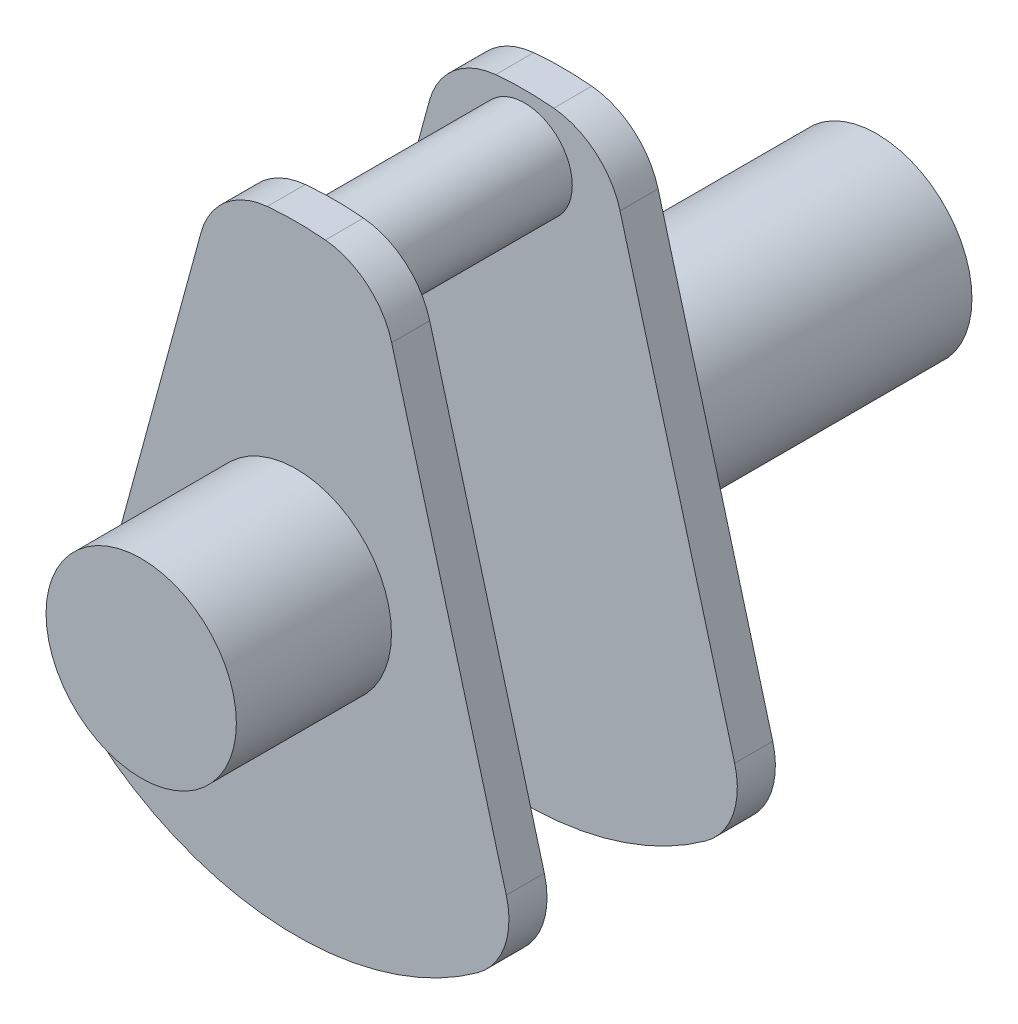
ISO-10303-21;
HEADER;
FILE_DESCRIPTION(('STEP AP214'),'2;1');
FILE_NAME('part.step','',(''),(''),'','','');
FILE_SCHEMA(('AUTOMOTIVE_DESIGN { 1 0 10303 214 1 1 1 1 }'));
ENDSEC;
DATA;
#1=APPLICATION_CONTEXT('core data for automotive mechanical design processes');
#2=APPLICATION_PROTOCOL_DEFINITION('international standard','automotive_design',2000,#1);
#3=PRODUCT_CONTEXT('',#1,'mechanical');
#4=PRODUCT('Part','Part','',(#3));
#5=PRODUCT_RELATED_PRODUCT_CATEGORY('part','',(#4));
#6=PRODUCT_DEFINITION_FORMATION('','',#4);
#7=PRODUCT_DEFINITION_CONTEXT('part definition',#1,'design');
#8=PRODUCT_DEFINITION('design','',#6,#7);
#9=PRODUCT_DEFINITION_SHAPE('','',#8);
#10=(LENGTH_UNIT() NAMED_UNIT(*) SI_UNIT(.MILLI.,.METRE.));
#11=(NAMED_UNIT(*) PLANE_ANGLE_UNIT() SI_UNIT($,.RADIAN.));
#12=(NAMED_UNIT(*) SI_UNIT($,.STERADIAN.) SOLID_ANGLE_UNIT());
#13=UNCERTAINTY_MEASURE_WITH_UNIT(LENGTH_MEASURE(1.E-05),#10,'distance_accuracy_value','');
#14=(GEOMETRIC_REPRESENTATION_CONTEXT(3) GLOBAL_UNCERTAINTY_ASSIGNED_CONTEXT((#13)) GLOBAL_UNIT_ASSIGNED_CONTEXT((#10,
#11,#12)) REPRESENTATION_CONTEXT('',''));
#15=CARTESIAN_POINT('',(0.,0.,0.));
#16=DIRECTION('',(0.,0.,1.));
#17=DIRECTION('',(1.,0.,0.));
#18=AXIS2_PLACEMENT_3D('',#15,#16,#17);
#19=CARTESIAN_POINT('',(0.46,4.87836038029172,0.8));
#20=DIRECTION('',(0.,0.,-1.));
#21=DIRECTION('',(-1.,0.,0.));
#22=AXIS2_PLACEMENT_3D('',#19,#20,#21);
#23=CYLINDRICAL_SURFACE('',#22,1.6);
#24=CARTESIAN_POINT('',(0.46,4.87836038029172,0.));
#25=DIRECTION('',(0.,0.,1.));
#26=DIRECTION('',(1.,0.,0.));
#27=AXIS2_PLACEMENT_3D('',#24,#25,#26);
#28=CIRCLE('',#27,1.6);
#29=CARTESIAN_POINT('',(2.00384320160388,5.29853673476862,0.));
#30=VERTEX_POINT('',#29);
#31=CARTESIAN_POINT('',(0.610204081632652,6.47129438201963,0.));
#32=VERTEX_POINT('',#31);
#33=EDGE_CURVE('E142',#30,#32,#28,.T.);
#34=ORIENTED_EDGE('',*,*,#33,.T.);
#35=DIRECTION('',(0.,0.,-1.));
#36=VECTOR('',#35,1.);
#37=CARTESIAN_POINT('',(0.610204081632652,6.47129438201963,0.8));
#38=LINE('',#37,#36);
#39=CARTESIAN_POINT('',(0.610204081632652,6.47129438201963,0.8));
#40=VERTEX_POINT('',#39);
#41=EDGE_CURVE('E40',#40,#32,#38,.T.);
#42=ORIENTED_EDGE('',*,*,#41,.F.);
#43=CARTESIAN_POINT('',(0.46,4.87836038029172,0.8));
#44=DIRECTION('',(0.,0.,1.));
#45=DIRECTION('',(1.,0.,0.));
#46=AXIS2_PLACEMENT_3D('',#43,#44,#45);
#47=CIRCLE('',#46,1.6);
#48=CARTESIAN_POINT('',(2.00384320160388,5.29853673476862,0.8));
#49=VERTEX_POINT('',#48);
#50=EDGE_CURVE('E158',#49,#40,#47,.T.);
#51=ORIENTED_EDGE('',*,*,#50,.F.);
#52=DIRECTION('',(0.,0.,-1.));
#53=VECTOR('',#52,1.);
#54=CARTESIAN_POINT('',(2.00384320160388,5.29853673476862,0.8));
#55=LINE('',#54,#53);
#56=EDGE_CURVE('E138',#49,#30,#55,.T.);
#57=ORIENTED_EDGE('',*,*,#56,.T.);
#58=EDGE_LOOP('',(#34,#42,#51,#57));
#59=FACE_BOUND('',#58,.T.);
#60=ADVANCED_FACE('F33',(#59),#23,.T.);
#61=CARTESIAN_POINT('',(0.,0.,0.8));
#62=DIRECTION('',(0.,0.,-1.));
#63=DIRECTION('',(-1.,0.,0.));
#64=AXIS2_PLACEMENT_3D('',#61,#62,#63);
#65=CYLINDRICAL_SURFACE('',#64,6.5);
#66=CARTESIAN_POINT('',(0.,0.,0.));
#67=DIRECTION('',(0.,0.,1.));
#68=DIRECTION('',(1.,0.,0.));
#69=AXIS2_PLACEMENT_3D('',#66,#67,#68);
#70=CIRCLE('',#69,6.5);
#71=CARTESIAN_POINT('',(-0.610204081632652,6.47129438201963,0.));
#72=VERTEX_POINT('',#71);
#73=EDGE_CURVE('E145',#32,#72,#70,.T.);
#74=ORIENTED_EDGE('',*,*,#73,.T.);
#75=DIRECTION('',(0.,0.,-1.));
#76=VECTOR('',#75,1.);
#77=CARTESIAN_POINT('',(-0.610204081632652,6.47129438201963,0.8));
#78=LINE('',#77,#76);
#79=CARTESIAN_POINT('',(-0.610204081632652,6.47129438201963,0.8));
#80=VERTEX_POINT('',#79);
#81=EDGE_CURVE('E168',#80,#72,#78,.T.);
#82=ORIENTED_EDGE('',*,*,#81,.F.);
#83=CARTESIAN_POINT('',(0.,0.,0.8));
#84=DIRECTION('',(0.,0.,1.));
#85=DIRECTION('',(1.,0.,0.));
#86=AXIS2_PLACEMENT_3D('',#83,#84,#85);
#87=CIRCLE('',#86,6.5);
#88=EDGE_CURVE('E98',#40,#80,#87,.T.);
#89=ORIENTED_EDGE('',*,*,#88,.F.);
#90=ORIENTED_EDGE('',*,*,#41,.T.);
#91=EDGE_LOOP('',(#74,#82,#89,#90));
#92=FACE_BOUND('',#91,.T.);
#93=ADVANCED_FACE('F171',(#92),#65,.T.);
#94=CARTESIAN_POINT('',(-0.46,4.87836038029172,0.8));
#95=DIRECTION('',(0.,0.,-1.));
#96=DIRECTION('',(-1.,0.,0.));
#97=AXIS2_PLACEMENT_3D('',#94,#95,#96);
#98=CYLINDRICAL_SURFACE('',#97,1.6);
#99=CARTESIAN_POINT('',(-0.46,4.87836038029172,0.));
#100=DIRECTION('',(0.,0.,1.));
#101=DIRECTION('',(-1.,0.,0.));
#102=AXIS2_PLACEMENT_3D('',#99,#100,#101);
#103=CIRCLE('',#102,1.6);
#104=CARTESIAN_POINT('',(-2.00384320160388,5.29853673476862,0.));
#105=VERTEX_POINT('',#104);
#106=EDGE_CURVE('E148',#72,#105,#103,.T.);
#107=ORIENTED_EDGE('',*,*,#106,.T.);
#108=DIRECTION('',(0.,0.,-1.));
#109=VECTOR('',#108,1.);
#110=CARTESIAN_POINT('',(-2.00384320160388,5.29853673476862,0.8));
#111=LINE('',#110,#109);
#112=CARTESIAN_POINT('',(-2.00384320160388,5.29853673476862,0.8));
#113=VERTEX_POINT('',#112);
#114=EDGE_CURVE('E165',#113,#105,#111,.T.);
#115=ORIENTED_EDGE('',*,*,#114,.F.);
#116=CARTESIAN_POINT('',(-0.46,4.87836038029172,0.8));
#117=DIRECTION('',(0.,0.,1.));
#118=DIRECTION('',(-1.,0.,0.));
#119=AXIS2_PLACEMENT_3D('',#116,#117,#118);
#120=CIRCLE('',#119,1.6);
#121=EDGE_CURVE('E189',#80,#113,#120,.T.);
#122=ORIENTED_EDGE('',*,*,#121,.F.);
#123=ORIENTED_EDGE('',*,*,#81,.T.);
#124=EDGE_LOOP('',(#107,#115,#122,#123));
#125=FACE_BOUND('',#124,.T.);
#126=ADVANCED_FACE('F182',(#125),#98,.T.);
#127=CARTESIAN_POINT('',(-2.00384320160388,5.29853673476862,0.8));
#128=DIRECTION('',(0.964902001002423,-0.26261022154806,0.));
#129=DIRECTION('',(0.26261022154806,0.964902001002423,0.));
#130=AXIS2_PLACEMENT_3D('',#127,#128,#129);
#131=PLANE('',#130);
#132=DIRECTION('',(-0.26261022154806,-0.964902001002423,0.));
#133=VECTOR('',#132,1.);
#134=CARTESIAN_POINT('',(-2.00384320160388,5.29853673476862,0.));
#135=LINE('',#134,#133);
#136=CARTESIAN_POINT('',(-4.41268219845804,-3.55219860392378,0.));
#137=VERTEX_POINT('',#136);
#138=EDGE_CURVE('E150',#105,#137,#135,.T.);
#139=ORIENTED_EDGE('',*,*,#138,.T.);
#140=DIRECTION('',(0.,0.,-1.));
#141=VECTOR('',#140,1.);
#142=CARTESIAN_POINT('',(-4.41268219845804,-3.55219860392378,0.8));
#143=LINE('',#142,#141);
#144=CARTESIAN_POINT('',(-4.41268219845804,-3.55219860392378,0.8));
#145=VERTEX_POINT('',#144);
#146=EDGE_CURVE('E162',#145,#137,#143,.T.);
#147=ORIENTED_EDGE('',*,*,#146,.F.);
#148=DIRECTION('',(-0.26261022154806,-0.964902001002423,0.));
#149=VECTOR('',#148,1.);
#150=CARTESIAN_POINT('',(-2.00384320160388,5.29853673476862,0.8));
#151=LINE('',#150,#149);
#152=EDGE_CURVE('E188',#113,#145,#151,.T.);
#153=ORIENTED_EDGE('',*,*,#152,.F.);
#154=ORIENTED_EDGE('',*,*,#114,.T.);
#155=EDGE_LOOP('',(#139,#147,#153,#154));
#156=FACE_BOUND('',#155,.T.);
#157=ADVANCED_FACE('F186',(#156),#131,.F.);
#158=CARTESIAN_POINT('',(-2.86883899685417,-3.97237495840068,0.8));
#159=DIRECTION('',(0.,0.,-1.));
#160=DIRECTION('',(-1.,0.,0.));
#161=AXIS2_PLACEMENT_3D('',#158,#159,#160);
#162=CYLINDRICAL_SURFACE('',#161,1.6);
#163=CARTESIAN_POINT('',(-2.86883899685417,-3.97237495840068,0.));
#164=DIRECTION('',(0.,0.,1.));
#165=DIRECTION('',(1.,0.,0.));
#166=AXIS2_PLACEMENT_3D('',#163,#164,#165);
#167=CIRCLE('',#166,1.6);
#168=CARTESIAN_POINT('',(-3.805602750929,-5.26947698563355,0.));
#169=VERTEX_POINT('',#168);
#170=EDGE_CURVE('E152',#137,#169,#167,.T.);
#171=ORIENTED_EDGE('',*,*,#170,.T.);
#172=DIRECTION('',(0.,0.,-1.));
#173=VECTOR('',#172,1.);
#174=CARTESIAN_POINT('',(-3.805602750929,-5.26947698563355,0.8));
#175=LINE('',#174,#173);
#176=CARTESIAN_POINT('',(-3.805602750929,-5.26947698563355,0.8));
#177=VERTEX_POINT('',#176);
#178=EDGE_CURVE('E133',#177,#169,#175,.T.);
#179=ORIENTED_EDGE('',*,*,#178,.F.);
#180=CARTESIAN_POINT('',(-2.86883899685417,-3.97237495840068,0.8));
#181=DIRECTION('',(0.,0.,1.));
#182=DIRECTION('',(1.,0.,0.));
#183=AXIS2_PLACEMENT_3D('',#180,#181,#182);
#184=CIRCLE('',#183,1.6);
#185=EDGE_CURVE('E121',#145,#177,#184,.T.);
#186=ORIENTED_EDGE('',*,*,#185,.F.);
#187=ORIENTED_EDGE('',*,*,#146,.T.);
#188=EDGE_LOOP('',(#171,#179,#186,#187));
#189=FACE_BOUND('',#188,.T.);
#190=ADVANCED_FACE('F430',(#189),#162,.T.);
#191=CARTESIAN_POINT('',(0.,0.,0.8));
#192=DIRECTION('',(0.,0.,-1.));
#193=DIRECTION('',(-1.,0.,0.));
#194=AXIS2_PLACEMENT_3D('',#191,#192,#193);
#195=CYLINDRICAL_SURFACE('',#194,6.5);
#196=CARTESIAN_POINT('',(0.,0.,0.));
#197=DIRECTION('',(0.,0.,1.));
#198=DIRECTION('',(1.,0.,0.));
#199=AXIS2_PLACEMENT_3D('',#196,#197,#198);
#200=CIRCLE('',#199,6.5);
#201=CARTESIAN_POINT('',(3.805602750929,-5.26947698563355,0.));
#202=VERTEX_POINT('',#201);
#203=EDGE_CURVE('E130',#169,#202,#200,.T.);
#204=ORIENTED_EDGE('',*,*,#203,.T.);
#205=DIRECTION('',(0.,0.,-1.));
#206=VECTOR('',#205,1.);
#207=CARTESIAN_POINT('',(3.805602750929,-5.26947698563355,0.8));
#208=LINE('',#207,#206);
#209=CARTESIAN_POINT('',(3.805602750929,-5.26947698563355,0.8));
#210=VERTEX_POINT('',#209);
#211=EDGE_CURVE('E127',#210,#202,#208,.T.);
#212=ORIENTED_EDGE('',*,*,#211,.F.);
#213=CARTESIAN_POINT('',(0.,0.,0.8));
#214=DIRECTION('',(0.,0.,1.));
#215=DIRECTION('',(1.,0.,0.));
#216=AXIS2_PLACEMENT_3D('',#213,#214,#215);
#217=CIRCLE('',#216,6.5);
#218=EDGE_CURVE('E114',#177,#210,#217,.T.);
#219=ORIENTED_EDGE('',*,*,#218,.F.);
#220=ORIENTED_EDGE('',*,*,#178,.T.);
#221=EDGE_LOOP('',(#204,#212,#219,#220));
#222=FACE_BOUND('',#221,.T.);
#223=ADVANCED_FACE('F128',(#222),#195,.T.);
#224=CARTESIAN_POINT('',(2.86883899685417,-3.97237495840068,0.8));
#225=DIRECTION('',(0.,0.,-1.));
#226=DIRECTION('',(-1.,0.,0.));
#227=AXIS2_PLACEMENT_3D('',#224,#225,#226);
#228=CYLINDRICAL_SURFACE('',#227,1.6);
#229=CARTESIAN_POINT('',(2.86883899685417,-3.97237495840068,0.));
#230=DIRECTION('',(0.,0.,1.));
#231=DIRECTION('',(-1.,0.,0.));
#232=AXIS2_PLACEMENT_3D('',#229,#230,#231);
#233=CIRCLE('',#232,1.6);
#234=CARTESIAN_POINT('',(4.41268219845804,-3.55219860392378,0.));
#235=VERTEX_POINT('',#234);
#236=EDGE_CURVE('E155',#202,#235,#233,.T.);
#237=ORIENTED_EDGE('',*,*,#236,.T.);
#238=DIRECTION('',(0.,0.,-1.));
#239=VECTOR('',#238,1.);
#240=CARTESIAN_POINT('',(4.41268219845804,-3.55219860392378,0.8));
#241=LINE('',#240,#239);
#242=CARTESIAN_POINT('',(4.41268219845804,-3.55219860392378,0.8));
#243=VERTEX_POINT('',#242);
#244=EDGE_CURVE('E134',#243,#235,#241,.T.);
#245=ORIENTED_EDGE('',*,*,#244,.F.);
#246=CARTESIAN_POINT('',(2.86883899685417,-3.97237495840068,0.8));
#247=DIRECTION('',(0.,0.,1.));
#248=DIRECTION('',(-1.,0.,0.));
#249=AXIS2_PLACEMENT_3D('',#246,#247,#248);
#250=CIRCLE('',#249,1.6);
#251=EDGE_CURVE('E118',#210,#243,#250,.T.);
#252=ORIENTED_EDGE('',*,*,#251,.F.);
#253=ORIENTED_EDGE('',*,*,#211,.T.);
#254=EDGE_LOOP('',(#237,#245,#252,#253));
#255=FACE_BOUND('',#254,.T.);
#256=ADVANCED_FACE('F136',(#255),#228,.T.);
#257=CARTESIAN_POINT('',(2.00384320160388,5.29853673476862,0.8));
#258=DIRECTION('',(-0.964902001002423,-0.26261022154806,0.));
#259=DIRECTION('',(0.26261022154806,-0.964902001002423,0.));
#260=AXIS2_PLACEMENT_3D('',#257,#258,#259);
#261=PLANE('',#260);
#262=DIRECTION('',(-0.26261022154806,0.964902001002422,0.));
#263=VECTOR('',#262,1.);
#264=CARTESIAN_POINT('',(2.00384320160388,5.29853673476862,0.));
#265=LINE('',#264,#263);
#266=EDGE_CURVE('E89',#235,#30,#265,.T.);
#267=ORIENTED_EDGE('',*,*,#266,.T.);
#268=ORIENTED_EDGE('',*,*,#56,.F.);
#269=DIRECTION('',(-0.26261022154806,0.964902001002422,0.));
#270=VECTOR('',#269,1.);
#271=CARTESIAN_POINT('',(2.00384320160388,5.29853673476862,0.8));
#272=LINE('',#271,#270);
#273=EDGE_CURVE('E56',#243,#49,#272,.T.);
#274=ORIENTED_EDGE('',*,*,#273,.F.);
#275=ORIENTED_EDGE('',*,*,#244,.T.);
#276=EDGE_LOOP('',(#267,#268,#274,#275));
#277=FACE_BOUND('',#276,.T.);
#278=ADVANCED_FACE('F438',(#277),#261,.F.);
#279=CARTESIAN_POINT('',(0.46,4.87836038029172,0.8));
#280=DIRECTION('',(0.,0.,1.));
#281=DIRECTION('',(1.,0.,0.));
#282=AXIS2_PLACEMENT_3D('',#279,#280,#281);
#283=PLANE('',#282);
#284=CARTESIAN_POINT('',(0.,5.26,0.8));
#285=DIRECTION('',(0.,0.,1.));
#286=DIRECTION('',(1.,0.,0.));
#287=AXIS2_PLACEMENT_3D('',#284,#285,#286);
#288=CIRCLE('',#287,1.);
#289=CARTESIAN_POINT('',(1.,5.26,0.8));
#290=VERTEX_POINT('',#289);
#291=EDGE_CURVE('E146',#290,#290,#288,.T.);
#292=ORIENTED_EDGE('',*,*,#291,.F.);
#293=EDGE_LOOP('',(#292));
#294=FACE_BOUND('',#293,.T.);
#295=ORIENTED_EDGE('',*,*,#50,.T.);
#296=ORIENTED_EDGE('',*,*,#88,.T.);
#297=ORIENTED_EDGE('',*,*,#121,.T.);
#298=ORIENTED_EDGE('',*,*,#152,.T.);
#299=ORIENTED_EDGE('',*,*,#185,.T.);
#300=ORIENTED_EDGE('',*,*,#218,.T.);
#301=ORIENTED_EDGE('',*,*,#251,.T.);
#302=ORIENTED_EDGE('',*,*,#273,.T.);
#303=EDGE_LOOP('',(#295,#296,#297,#298,#299,#300,#301,#302));
#304=FACE_BOUND('',#303,.T.);
#305=ADVANCED_FACE('F116',(#294,#304),#283,.T.);
#306=CARTESIAN_POINT('',(0.46,4.87836038029172,0.));
#307=DIRECTION('',(0.,0.,1.));
#308=DIRECTION('',(1.,0.,0.));
#309=AXIS2_PLACEMENT_3D('',#306,#307,#308);
#310=PLANE('',#309);
#311=DIRECTION('',(-1.,0.,0.));
#312=VECTOR('',#311,1.);
#313=CARTESIAN_POINT('',(0.,2.01934807239749,0.));
#314=LINE('',#313,#312);
#315=CARTESIAN_POINT('',(0.,2.01934807239749,0.));
#316=VERTEX_POINT('',#315);
#317=CARTESIAN_POINT('',(-0.1,2.01934807239749,0.));
#318=VERTEX_POINT('',#317);
#319=EDGE_CURVE('E299',#316,#318,#314,.T.);
#320=ORIENTED_EDGE('',*,*,#319,.F.);
#321=DIRECTION('',(0.,-1.,0.));
#322=VECTOR('',#321,1.);
#323=CARTESIAN_POINT('',(0.,2.51934807239749,0.));
#324=LINE('',#323,#322);
#325=CARTESIAN_POINT('',(0.,2.51934807239749,0.));
#326=VERTEX_POINT('',#325);
#327=EDGE_CURVE('E47',#326,#316,#324,.T.);
#328=ORIENTED_EDGE('',*,*,#327,.F.);
#329=DIRECTION('',(1.,0.,0.));
#330=VECTOR('',#329,1.);
#331=CARTESIAN_POINT('',(0.,2.51934807239749,0.));
#332=LINE('',#331,#330);
#333=CARTESIAN_POINT('',(-0.1,2.51934807239749,0.));
#334=VERTEX_POINT('',#333);
#335=EDGE_CURVE('E292',#334,#326,#332,.T.);
#336=ORIENTED_EDGE('',*,*,#335,.F.);
#337=DIRECTION('',(0.,1.,0.));
#338=VECTOR('',#337,1.);
#339=CARTESIAN_POINT('',(-0.1,2.51934807239749,0.));
#340=LINE('',#339,#338);
#341=EDGE_CURVE('E296',#318,#334,#340,.T.);
#342=ORIENTED_EDGE('',*,*,#341,.F.);
#343=EDGE_LOOP('',(#320,#328,#336,#342));
#344=FACE_BOUND('',#343,.T.);
#345=CARTESIAN_POINT('',(0.,0.,0.));
#346=DIRECTION('',(0.,0.,1.));
#347=DIRECTION('',(1.,0.,0.));
#348=AXIS2_PLACEMENT_3D('',#345,#346,#347);
#349=CIRCLE('',#348,2.);
#350=CARTESIAN_POINT('',(2.,0.,0.));
#351=VERTEX_POINT('',#350);
#352=EDGE_CURVE('E11',#351,#351,#349,.F.);
#353=ORIENTED_EDGE('',*,*,#352,.F.);
#354=EDGE_LOOP('',(#353));
#355=FACE_BOUND('',#354,.T.);
#356=ORIENTED_EDGE('',*,*,#33,.F.);
#357=ORIENTED_EDGE('',*,*,#266,.F.);
#358=ORIENTED_EDGE('',*,*,#236,.F.);
#359=ORIENTED_EDGE('',*,*,#203,.F.);
#360=ORIENTED_EDGE('',*,*,#170,.F.);
#361=ORIENTED_EDGE('',*,*,#138,.F.);
#362=ORIENTED_EDGE('',*,*,#106,.F.);
#363=ORIENTED_EDGE('',*,*,#73,.F.);
#364=EDGE_LOOP('',(#356,#357,#358,#359,#360,#361,#362,#363));
#365=FACE_BOUND('',#364,.T.);
#366=ADVANCED_FACE('F176',(#344,#355,#365),#310,.F.);
#367=CARTESIAN_POINT('',(0.,5.26,2.8));
#368=DIRECTION('',(0.,0.,-1.));
#369=DIRECTION('',(-1.,0.,0.));
#370=AXIS2_PLACEMENT_3D('',#367,#368,#369);
#371=CYLINDRICAL_SURFACE('',#370,1.);
#372=ORIENTED_EDGE('',*,*,#291,.T.);
#373=EDGE_LOOP('',(#372));
#374=FACE_BOUND('',#373,.T.);
#375=CARTESIAN_POINT('',(0.,5.26,4.8));
#376=DIRECTION('',(0.,0.,1.));
#377=DIRECTION('',(1.,0.,0.));
#378=AXIS2_PLACEMENT_3D('',#375,#376,#377);
#379=CIRCLE('',#378,1.);
#380=CARTESIAN_POINT('',(1.,5.26,4.8));
#381=VERTEX_POINT('',#380);
#382=EDGE_CURVE('E250',#381,#381,#379,.T.);
#383=ORIENTED_EDGE('',*,*,#382,.F.);
#384=EDGE_LOOP('',(#383));
#385=FACE_BOUND('',#384,.T.);
#386=ADVANCED_FACE('F443',(#374,#385),#371,.T.);
#387=CARTESIAN_POINT('',(0.,0.,-3.26));
#388=DIRECTION('',(0.,0.,1.));
#389=DIRECTION('',(1.,0.,0.));
#390=AXIS2_PLACEMENT_3D('',#387,#388,#389);
#391=CYLINDRICAL_SURFACE('',#390,2.);
#392=ORIENTED_EDGE('',*,*,#352,.T.);
#393=EDGE_LOOP('',(#392));
#394=FACE_BOUND('',#393,.T.);
#395=CARTESIAN_POINT('',(0.,0.,-6.6));
#396=DIRECTION('',(0.,0.,-1.));
#397=DIRECTION('',(-1.,0.,0.));
#398=AXIS2_PLACEMENT_3D('',#395,#396,#397);
#399=CIRCLE('',#398,2.);
#400=CARTESIAN_POINT('',(-2.,0.,-6.6));
#401=VERTEX_POINT('',#400);
#402=EDGE_CURVE('E278',#401,#401,#399,.T.);
#403=ORIENTED_EDGE('',*,*,#402,.F.);
#404=EDGE_LOOP('',(#403));
#405=FACE_BOUND('',#404,.T.);
#406=ADVANCED_FACE('F450',(#394,#405),#391,.T.);
#407=CARTESIAN_POINT('',(0.46,4.87836038029172,4.8));
#408=DIRECTION('',(0.,0.,1.));
#409=DIRECTION('',(-1.,0.,0.));
#410=AXIS2_PLACEMENT_3D('',#407,#408,#409);
#411=CYLINDRICAL_SURFACE('',#410,1.6);
#412=CARTESIAN_POINT('',(0.46,4.87836038029172,5.6));
#413=DIRECTION('',(0.,0.,1.));
#414=DIRECTION('',(1.,0.,0.));
#415=AXIS2_PLACEMENT_3D('',#412,#413,#414);
#416=CIRCLE('',#415,1.6);
#417=CARTESIAN_POINT('',(2.00384320160388,5.29853673476862,5.6));
#418=VERTEX_POINT('',#417);
#419=CARTESIAN_POINT('',(0.610204081632652,6.47129438201963,5.6));
#420=VERTEX_POINT('',#419);
#421=EDGE_CURVE('E247',#418,#420,#416,.T.);
#422=ORIENTED_EDGE('',*,*,#421,.F.);
#423=DIRECTION('',(0.,0.,1.));
#424=VECTOR('',#423,1.);
#425=CARTESIAN_POINT('',(2.00384320160388,5.29853673476862,4.8));
#426=LINE('',#425,#424);
#427=CARTESIAN_POINT('',(2.00384320160388,5.29853673476862,4.8));
#428=VERTEX_POINT('',#427);
#429=EDGE_CURVE('E221',#428,#418,#426,.T.);
#430=ORIENTED_EDGE('',*,*,#429,.F.);
#431=CARTESIAN_POINT('',(0.46,4.87836038029172,4.8));
#432=DIRECTION('',(0.,0.,1.));
#433=DIRECTION('',(1.,0.,0.));
#434=AXIS2_PLACEMENT_3D('',#431,#432,#433);
#435=CIRCLE('',#434,1.6);
#436=CARTESIAN_POINT('',(0.610204081632652,6.47129438201963,4.8));
#437=VERTEX_POINT('',#436);
#438=EDGE_CURVE('E228',#428,#437,#435,.T.);
#439=ORIENTED_EDGE('',*,*,#438,.T.);
#440=DIRECTION('',(0.,0.,1.));
#441=VECTOR('',#440,1.);
#442=CARTESIAN_POINT('',(0.610204081632652,6.47129438201963,4.8));
#443=LINE('',#442,#441);
#444=EDGE_CURVE('E200',#437,#420,#443,.T.);
#445=ORIENTED_EDGE('',*,*,#444,.T.);
#446=EDGE_LOOP('',(#422,#430,#439,#445));
#447=FACE_BOUND('',#446,.T.);
#448=ADVANCED_FACE('F386',(#447),#411,.T.);
#449=CARTESIAN_POINT('',(0.,0.,4.8));
#450=DIRECTION('',(0.,0.,1.));
#451=DIRECTION('',(-1.,0.,0.));
#452=AXIS2_PLACEMENT_3D('',#449,#450,#451);
#453=CYLINDRICAL_SURFACE('',#452,6.5);
#454=CARTESIAN_POINT('',(0.,0.,5.6));
#455=DIRECTION('',(0.,0.,1.));
#456=DIRECTION('',(1.,0.,0.));
#457=AXIS2_PLACEMENT_3D('',#454,#455,#456);
#458=CIRCLE('',#457,6.5);
#459=CARTESIAN_POINT('',(-0.610204081632652,6.47129438201963,5.6));
#460=VERTEX_POINT('',#459);
#461=EDGE_CURVE('E244',#420,#460,#458,.T.);
#462=ORIENTED_EDGE('',*,*,#461,.F.);
#463=ORIENTED_EDGE('',*,*,#444,.F.);
#464=CARTESIAN_POINT('',(0.,0.,4.8));
#465=DIRECTION('',(0.,0.,1.));
#466=DIRECTION('',(1.,0.,0.));
#467=AXIS2_PLACEMENT_3D('',#464,#465,#466);
#468=CIRCLE('',#467,6.5);
#469=CARTESIAN_POINT('',(-0.610204081632652,6.47129438201963,4.8));
#470=VERTEX_POINT('',#469);
#471=EDGE_CURVE('E268',#437,#470,#468,.T.);
#472=ORIENTED_EDGE('',*,*,#471,.T.);
#473=DIRECTION('',(0.,0.,1.));
#474=VECTOR('',#473,1.);
#475=CARTESIAN_POINT('',(-0.610204081632652,6.47129438201963,4.8));
#476=LINE('',#475,#474);
#477=EDGE_CURVE('E203',#470,#460,#476,.T.);
#478=ORIENTED_EDGE('',*,*,#477,.T.);
#479=EDGE_LOOP('',(#462,#463,#472,#478));
#480=FACE_BOUND('',#479,.T.);
#481=ADVANCED_FACE('F389',(#480),#453,.T.);
#482=CARTESIAN_POINT('',(-0.46,4.87836038029172,4.8));
#483=DIRECTION('',(0.,0.,1.));
#484=DIRECTION('',(-1.,0.,0.));
#485=AXIS2_PLACEMENT_3D('',#482,#483,#484);
#486=CYLINDRICAL_SURFACE('',#485,1.6);
#487=CARTESIAN_POINT('',(-0.46,4.87836038029172,5.6));
#488=DIRECTION('',(0.,0.,1.));
#489=DIRECTION('',(-1.,0.,0.));
#490=AXIS2_PLACEMENT_3D('',#487,#488,#489);
#491=CIRCLE('',#490,1.6);
#492=CARTESIAN_POINT('',(-2.00384320160388,5.29853673476862,5.6));
#493=VERTEX_POINT('',#492);
#494=EDGE_CURVE('E241',#460,#493,#491,.T.);
#495=ORIENTED_EDGE('',*,*,#494,.F.);
#496=ORIENTED_EDGE('',*,*,#477,.F.);
#497=CARTESIAN_POINT('',(-0.46,4.87836038029172,4.8));
#498=DIRECTION('',(0.,0.,1.));
#499=DIRECTION('',(-1.,0.,0.));
#500=AXIS2_PLACEMENT_3D('',#497,#498,#499);
#501=CIRCLE('',#500,1.6);
#502=CARTESIAN_POINT('',(-2.00384320160388,5.29853673476862,4.8));
#503=VERTEX_POINT('',#502);
#504=EDGE_CURVE('E265',#470,#503,#501,.T.);
#505=ORIENTED_EDGE('',*,*,#504,.T.);
#506=DIRECTION('',(0.,0.,1.));
#507=VECTOR('',#506,1.);
#508=CARTESIAN_POINT('',(-2.00384320160388,5.29853673476862,4.8));
#509=LINE('',#508,#507);
#510=EDGE_CURVE('E206',#503,#493,#509,.T.);
#511=ORIENTED_EDGE('',*,*,#510,.T.);
#512=EDGE_LOOP('',(#495,#496,#505,#511));
#513=FACE_BOUND('',#512,.T.);
#514=ADVANCED_FACE('F392',(#513),#486,.T.);
#515=CARTESIAN_POINT('',(-2.00384320160388,5.29853673476862,4.8));
#516=DIRECTION('',(0.964902001002423,-0.26261022154806,0.));
#517=DIRECTION('',(0.26261022154806,0.964902001002423,0.));
#518=AXIS2_PLACEMENT_3D('',#515,#516,#517);
#519=PLANE('',#518);
#520=DIRECTION('',(-0.26261022154806,-0.964902001002423,0.));
#521=VECTOR('',#520,1.);
#522=CARTESIAN_POINT('',(-2.00384320160388,5.29853673476862,5.6));
#523=LINE('',#522,#521);
#524=CARTESIAN_POINT('',(-4.41268219845804,-3.55219860392378,5.6));
#525=VERTEX_POINT('',#524);
#526=EDGE_CURVE('E238',#493,#525,#523,.T.);
#527=ORIENTED_EDGE('',*,*,#526,.F.);
#528=ORIENTED_EDGE('',*,*,#510,.F.);
#529=DIRECTION('',(-0.26261022154806,-0.964902001002423,0.));
#530=VECTOR('',#529,1.);
#531=CARTESIAN_POINT('',(-2.00384320160388,5.29853673476862,4.8));
#532=LINE('',#531,#530);
#533=CARTESIAN_POINT('',(-4.41268219845804,-3.55219860392378,4.8));
#534=VERTEX_POINT('',#533);
#535=EDGE_CURVE('E262',#503,#534,#532,.T.);
#536=ORIENTED_EDGE('',*,*,#535,.T.);
#537=DIRECTION('',(0.,0.,1.));
#538=VECTOR('',#537,1.);
#539=CARTESIAN_POINT('',(-4.41268219845804,-3.55219860392378,4.8));
#540=LINE('',#539,#538);
#541=EDGE_CURVE('E209',#534,#525,#540,.T.);
#542=ORIENTED_EDGE('',*,*,#541,.T.);
#543=EDGE_LOOP('',(#527,#528,#536,#542));
#544=FACE_BOUND('',#543,.T.);
#545=ADVANCED_FACE('F395',(#544),#519,.F.);
#546=CARTESIAN_POINT('',(-2.86883899685417,-3.97237495840068,4.8));
#547=DIRECTION('',(0.,0.,1.));
#548=DIRECTION('',(-1.,0.,0.));
#549=AXIS2_PLACEMENT_3D('',#546,#547,#548);
#550=CYLINDRICAL_SURFACE('',#549,1.6);
#551=CARTESIAN_POINT('',(-2.86883899685417,-3.97237495840068,5.6));
#552=DIRECTION('',(0.,0.,1.));
#553=DIRECTION('',(1.,0.,0.));
#554=AXIS2_PLACEMENT_3D('',#551,#552,#553);
#555=CIRCLE('',#554,1.6);
#556=CARTESIAN_POINT('',(-3.805602750929,-5.26947698563355,5.6));
#557=VERTEX_POINT('',#556);
#558=EDGE_CURVE('E235',#525,#557,#555,.T.);
#559=ORIENTED_EDGE('',*,*,#558,.F.);
#560=ORIENTED_EDGE('',*,*,#541,.F.);
#561=CARTESIAN_POINT('',(-2.86883899685417,-3.97237495840068,4.8));
#562=DIRECTION('',(0.,0.,1.));
#563=DIRECTION('',(1.,0.,0.));
#564=AXIS2_PLACEMENT_3D('',#561,#562,#563);
#565=CIRCLE('',#564,1.6);
#566=CARTESIAN_POINT('',(-3.805602750929,-5.26947698563355,4.8));
#567=VERTEX_POINT('',#566);
#568=EDGE_CURVE('E259',#534,#567,#565,.T.);
#569=ORIENTED_EDGE('',*,*,#568,.T.);
#570=DIRECTION('',(0.,0.,1.));
#571=VECTOR('',#570,1.);
#572=CARTESIAN_POINT('',(-3.805602750929,-5.26947698563355,4.8));
#573=LINE('',#572,#571);
#574=EDGE_CURVE('E212',#567,#557,#573,.T.);
#575=ORIENTED_EDGE('',*,*,#574,.T.);
#576=EDGE_LOOP('',(#559,#560,#569,#575));
#577=FACE_BOUND('',#576,.T.);
#578=ADVANCED_FACE('F398',(#577),#550,.T.);
#579=CARTESIAN_POINT('',(0.,0.,4.8));
#580=DIRECTION('',(0.,0.,1.));
#581=DIRECTION('',(-1.,0.,0.));
#582=AXIS2_PLACEMENT_3D('',#579,#580,#581);
#583=CYLINDRICAL_SURFACE('',#582,6.5);
#584=CARTESIAN_POINT('',(0.,0.,5.6));
#585=DIRECTION('',(0.,0.,1.));
#586=DIRECTION('',(1.,0.,0.));
#587=AXIS2_PLACEMENT_3D('',#584,#585,#586);
#588=CIRCLE('',#587,6.5);
#589=CARTESIAN_POINT('',(3.805602750929,-5.26947698563355,5.6));
#590=VERTEX_POINT('',#589);
#591=EDGE_CURVE('E232',#557,#590,#588,.T.);
#592=ORIENTED_EDGE('',*,*,#591,.F.);
#593=ORIENTED_EDGE('',*,*,#574,.F.);
#594=CARTESIAN_POINT('',(0.,0.,4.8));
#595=DIRECTION('',(0.,0.,1.));
#596=DIRECTION('',(1.,0.,0.));
#597=AXIS2_PLACEMENT_3D('',#594,#595,#596);
#598=CIRCLE('',#597,6.5);
#599=CARTESIAN_POINT('',(3.805602750929,-5.26947698563355,4.8));
#600=VERTEX_POINT('',#599);
#601=EDGE_CURVE('E256',#567,#600,#598,.T.);
#602=ORIENTED_EDGE('',*,*,#601,.T.);
#603=DIRECTION('',(0.,0.,1.));
#604=VECTOR('',#603,1.);
#605=CARTESIAN_POINT('',(3.805602750929,-5.26947698563355,4.8));
#606=LINE('',#605,#604);
#607=EDGE_CURVE('E215',#600,#590,#606,.T.);
#608=ORIENTED_EDGE('',*,*,#607,.T.);
#609=EDGE_LOOP('',(#592,#593,#602,#608));
#610=FACE_BOUND('',#609,.T.);
#611=ADVANCED_FACE('F401',(#610),#583,.T.);
#612=CARTESIAN_POINT('',(2.86883899685417,-3.97237495840068,4.8));
#613=DIRECTION('',(0.,0.,1.));
#614=DIRECTION('',(-1.,0.,0.));
#615=AXIS2_PLACEMENT_3D('',#612,#613,#614);
#616=CYLINDRICAL_SURFACE('',#615,1.6);
#617=CARTESIAN_POINT('',(2.86883899685417,-3.97237495840068,5.6));
#618=DIRECTION('',(0.,0.,1.));
#619=DIRECTION('',(-1.,0.,0.));
#620=AXIS2_PLACEMENT_3D('',#617,#618,#619);
#621=CIRCLE('',#620,1.6);
#622=CARTESIAN_POINT('',(4.41268219845804,-3.55219860392378,5.6));
#623=VERTEX_POINT('',#622);
#624=EDGE_CURVE('E229',#590,#623,#621,.T.);
#625=ORIENTED_EDGE('',*,*,#624,.F.);
#626=ORIENTED_EDGE('',*,*,#607,.F.);
#627=CARTESIAN_POINT('',(2.86883899685417,-3.97237495840068,4.8));
#628=DIRECTION('',(0.,0.,1.));
#629=DIRECTION('',(-1.,0.,0.));
#630=AXIS2_PLACEMENT_3D('',#627,#628,#629);
#631=CIRCLE('',#630,1.6);
#632=CARTESIAN_POINT('',(4.41268219845804,-3.55219860392378,4.8));
#633=VERTEX_POINT('',#632);
#634=EDGE_CURVE('E253',#600,#633,#631,.T.);
#635=ORIENTED_EDGE('',*,*,#634,.T.);
#636=DIRECTION('',(0.,0.,1.));
#637=VECTOR('',#636,1.);
#638=CARTESIAN_POINT('',(4.41268219845804,-3.55219860392378,4.8));
#639=LINE('',#638,#637);
#640=EDGE_CURVE('E218',#633,#623,#639,.T.);
#641=ORIENTED_EDGE('',*,*,#640,.T.);
#642=EDGE_LOOP('',(#625,#626,#635,#641));
#643=FACE_BOUND('',#642,.T.);
#644=ADVANCED_FACE('F404',(#643),#616,.T.);
#645=CARTESIAN_POINT('',(2.00384320160388,5.29853673476862,4.8));
#646=DIRECTION('',(-0.964902001002423,-0.26261022154806,0.));
#647=DIRECTION('',(0.26261022154806,-0.964902001002423,0.));
#648=AXIS2_PLACEMENT_3D('',#645,#646,#647);
#649=PLANE('',#648);
#650=DIRECTION('',(-0.26261022154806,0.964902001002422,0.));
#651=VECTOR('',#650,1.);
#652=CARTESIAN_POINT('',(2.00384320160388,5.29853673476862,5.6));
#653=LINE('',#652,#651);
#654=EDGE_CURVE('E225',#623,#418,#653,.T.);
#655=ORIENTED_EDGE('',*,*,#654,.F.);
#656=ORIENTED_EDGE('',*,*,#640,.F.);
#657=DIRECTION('',(-0.26261022154806,0.964902001002422,0.));
#658=VECTOR('',#657,1.);
#659=CARTESIAN_POINT('',(2.00384320160388,5.29853673476862,4.8));
#660=LINE('',#659,#658);
#661=EDGE_CURVE('E224',#633,#428,#660,.T.);
#662=ORIENTED_EDGE('',*,*,#661,.T.);
#663=ORIENTED_EDGE('',*,*,#429,.T.);
#664=EDGE_LOOP('',(#655,#656,#662,#663));
#665=FACE_BOUND('',#664,.T.);
#666=ADVANCED_FACE('F383',(#665),#649,.F.);
#667=CARTESIAN_POINT('',(0.46,4.87836038029172,4.8));
#668=DIRECTION('',(0.,0.,-1.));
#669=DIRECTION('',(1.,0.,0.));
#670=AXIS2_PLACEMENT_3D('',#667,#668,#669);
#671=PLANE('',#670);
#672=ORIENTED_EDGE('',*,*,#382,.T.);
#673=EDGE_LOOP('',(#672));
#674=FACE_BOUND('',#673,.T.);
#675=ORIENTED_EDGE('',*,*,#438,.F.);
#676=ORIENTED_EDGE('',*,*,#661,.F.);
#677=ORIENTED_EDGE('',*,*,#634,.F.);
#678=ORIENTED_EDGE('',*,*,#601,.F.);
#679=ORIENTED_EDGE('',*,*,#568,.F.);
#680=ORIENTED_EDGE('',*,*,#535,.F.);
#681=ORIENTED_EDGE('',*,*,#504,.F.);
#682=ORIENTED_EDGE('',*,*,#471,.F.);
#683=EDGE_LOOP('',(#675,#676,#677,#678,#679,#680,#681,#682));
#684=FACE_BOUND('',#683,.T.);
#685=ADVANCED_FACE('F406',(#674,#684),#671,.T.);
#686=CARTESIAN_POINT('',(0.46,4.87836038029172,5.6));
#687=DIRECTION('',(0.,0.,-1.));
#688=DIRECTION('',(1.,0.,0.));
#689=AXIS2_PLACEMENT_3D('',#686,#687,#688);
#690=PLANE('',#689);
#691=CARTESIAN_POINT('',(0.,0.,5.6));
#692=DIRECTION('',(0.,0.,1.));
#693=DIRECTION('',(1.,0.,0.));
#694=AXIS2_PLACEMENT_3D('',#691,#692,#693);
#695=CIRCLE('',#694,2.);
#696=CARTESIAN_POINT('',(2.,0.,5.6));
#697=VERTEX_POINT('',#696);
#698=EDGE_CURVE('E197',#697,#697,#695,.F.);
#699=ORIENTED_EDGE('',*,*,#698,.T.);
#700=EDGE_LOOP('',(#699));
#701=FACE_BOUND('',#700,.T.);
#702=ORIENTED_EDGE('',*,*,#421,.T.);
#703=ORIENTED_EDGE('',*,*,#461,.T.);
#704=ORIENTED_EDGE('',*,*,#494,.T.);
#705=ORIENTED_EDGE('',*,*,#526,.T.);
#706=ORIENTED_EDGE('',*,*,#558,.T.);
#707=ORIENTED_EDGE('',*,*,#591,.T.);
#708=ORIENTED_EDGE('',*,*,#624,.T.);
#709=ORIENTED_EDGE('',*,*,#654,.T.);
#710=EDGE_LOOP('',(#702,#703,#704,#705,#706,#707,#708,#709));
#711=FACE_BOUND('',#710,.T.);
#712=ADVANCED_FACE('F380',(#701,#711),#690,.F.);
#713=CARTESIAN_POINT('',(0.,0.,8.86));
#714=DIRECTION('',(0.,0.,-1.));
#715=DIRECTION('',(1.,0.,0.));
#716=AXIS2_PLACEMENT_3D('',#713,#714,#715);
#717=CYLINDRICAL_SURFACE('',#716,2.);
#718=CARTESIAN_POINT('',(0.,0.,8.86));
#719=DIRECTION('',(0.,0.,-1.));
#720=DIRECTION('',(-1.,0.,0.));
#721=AXIS2_PLACEMENT_3D('',#718,#719,#720);
#722=CIRCLE('',#721,2.);
#723=CARTESIAN_POINT('',(-2.,0.,8.86));
#724=VERTEX_POINT('',#723);
#725=EDGE_CURVE('E275',#724,#724,#722,.T.);
#726=ORIENTED_EDGE('',*,*,#725,.T.);
#727=EDGE_LOOP('',(#726));
#728=FACE_BOUND('',#727,.T.);
#729=ORIENTED_EDGE('',*,*,#698,.F.);
#730=EDGE_LOOP('',(#729));
#731=FACE_BOUND('',#730,.T.);
#732=ADVANCED_FACE('F414',(#728,#731),#717,.T.);
#733=CARTESIAN_POINT('',(0.,0.,8.86));
#734=DIRECTION('',(0.,0.,1.));
#735=DIRECTION('',(-1.,0.,0.));
#736=AXIS2_PLACEMENT_3D('',#733,#734,#735);
#737=PLANE('',#736);
#738=ORIENTED_EDGE('',*,*,#725,.F.);
#739=EDGE_LOOP('',(#738));
#740=FACE_BOUND('',#739,.T.);
#741=ADVANCED_FACE('F495',(#740),#737,.T.);
#742=CARTESIAN_POINT('',(0.,0.,-6.6));
#743=DIRECTION('',(0.,0.,-1.));
#744=DIRECTION('',(-1.,0.,0.));
#745=AXIS2_PLACEMENT_3D('',#742,#743,#744);
#746=PLANE('',#745);
#747=ORIENTED_EDGE('',*,*,#402,.T.);
#748=EDGE_LOOP('',(#747));
#749=FACE_BOUND('',#748,.T.);
#750=ADVANCED_FACE('F504',(#749),#746,.T.);
#751=CARTESIAN_POINT('',(0.,2.51934807239749,0.1));
#752=DIRECTION('',(1.,0.,0.));
#753=DIRECTION('',(0.,0.,-1.));
#754=AXIS2_PLACEMENT_3D('',#751,#752,#753);
#755=PLANE('',#754);
#756=ORIENTED_EDGE('',*,*,#327,.T.);
#757=DIRECTION('',(0.,0.,-1.));
#758=VECTOR('',#757,1.);
#759=CARTESIAN_POINT('',(0.,2.01934807239749,0.1));
#760=LINE('',#759,#758);
#761=CARTESIAN_POINT('',(0.,2.01934807239749,0.1));
#762=VERTEX_POINT('',#761);
#763=EDGE_CURVE('E282',#762,#316,#760,.T.);
#764=ORIENTED_EDGE('',*,*,#763,.F.);
#765=DIRECTION('',(0.,-1.,0.));
#766=VECTOR('',#765,1.);
#767=CARTESIAN_POINT('',(0.,2.51934807239749,0.1));
#768=LINE('',#767,#766);
#769=CARTESIAN_POINT('',(0.,2.51934807239749,0.1));
#770=VERTEX_POINT('',#769);
#771=EDGE_CURVE('E295',#770,#762,#768,.T.);
#772=ORIENTED_EDGE('',*,*,#771,.F.);
#773=DIRECTION('',(0.,0.,-1.));
#774=VECTOR('',#773,1.);
#775=CARTESIAN_POINT('',(0.,2.51934807239749,0.1));
#776=LINE('',#775,#774);
#777=EDGE_CURVE('E281',#770,#326,#776,.T.);
#778=ORIENTED_EDGE('',*,*,#777,.T.);
#779=EDGE_LOOP('',(#756,#764,#772,#778));
#780=FACE_BOUND('',#779,.T.);
#781=ADVANCED_FACE('F322',(#780),#755,.F.);
#782=CARTESIAN_POINT('',(0.,2.51934807239749,0.1));
#783=DIRECTION('',(0.,1.,0.));
#784=DIRECTION('',(0.,0.,1.));
#785=AXIS2_PLACEMENT_3D('',#782,#783,#784);
#786=PLANE('',#785);
#787=ORIENTED_EDGE('',*,*,#335,.T.);
#788=ORIENTED_EDGE('',*,*,#777,.F.);
#789=DIRECTION('',(1.,0.,0.));
#790=VECTOR('',#789,1.);
#791=CARTESIAN_POINT('',(0.,2.51934807239749,0.1));
#792=LINE('',#791,#790);
#793=CARTESIAN_POINT('',(-0.1,2.51934807239749,0.1));
#794=VERTEX_POINT('',#793);
#795=EDGE_CURVE('E285',#794,#770,#792,.T.);
#796=ORIENTED_EDGE('',*,*,#795,.F.);
#797=DIRECTION('',(0.,0.,-1.));
#798=VECTOR('',#797,1.);
#799=CARTESIAN_POINT('',(-0.1,2.51934807239749,0.1));
#800=LINE('',#799,#798);
#801=EDGE_CURVE('E288',#794,#334,#800,.T.);
#802=ORIENTED_EDGE('',*,*,#801,.T.);
#803=EDGE_LOOP('',(#787,#788,#796,#802));
#804=FACE_BOUND('',#803,.T.);
#805=ADVANCED_FACE('F534',(#804),#786,.F.);
#806=CARTESIAN_POINT('',(-0.1,2.51934807239749,0.1));
#807=DIRECTION('',(-1.,0.,0.));
#808=DIRECTION('',(0.,-1.,0.));
#809=AXIS2_PLACEMENT_3D('',#806,#807,#808);
#810=PLANE('',#809);
#811=ORIENTED_EDGE('',*,*,#341,.T.);
#812=ORIENTED_EDGE('',*,*,#801,.F.);
#813=DIRECTION('',(0.,1.,0.));
#814=VECTOR('',#813,1.);
#815=CARTESIAN_POINT('',(-0.1,2.51934807239749,0.1));
#816=LINE('',#815,#814);
#817=CARTESIAN_POINT('',(-0.1,2.01934807239749,0.1));
#818=VERTEX_POINT('',#817);
#819=EDGE_CURVE('E305',#818,#794,#816,.T.);
#820=ORIENTED_EDGE('',*,*,#819,.F.);
#821=DIRECTION('',(0.,0.,-1.));
#822=VECTOR('',#821,1.);
#823=CARTESIAN_POINT('',(-0.1,2.01934807239749,0.1));
#824=LINE('',#823,#822);
#825=EDGE_CURVE('E284',#818,#318,#824,.T.);
#826=ORIENTED_EDGE('',*,*,#825,.T.);
#827=EDGE_LOOP('',(#811,#812,#820,#826));
#828=FACE_BOUND('',#827,.T.);
#829=ADVANCED_FACE('F543',(#828),#810,.F.);
#830=CARTESIAN_POINT('',(0.,2.01934807239749,0.1));
#831=DIRECTION('',(0.,-1.,0.));
#832=DIRECTION('',(0.,0.,-1.));
#833=AXIS2_PLACEMENT_3D('',#830,#831,#832);
#834=PLANE('',#833);
#835=ORIENTED_EDGE('',*,*,#319,.T.);
#836=ORIENTED_EDGE('',*,*,#825,.F.);
#837=DIRECTION('',(-1.,0.,0.));
#838=VECTOR('',#837,1.);
#839=CARTESIAN_POINT('',(0.,2.01934807239749,0.1));
#840=LINE('',#839,#838);
#841=EDGE_CURVE('E308',#762,#818,#840,.T.);
#842=ORIENTED_EDGE('',*,*,#841,.F.);
#843=ORIENTED_EDGE('',*,*,#763,.T.);
#844=EDGE_LOOP('',(#835,#836,#842,#843));
#845=FACE_BOUND('',#844,.T.);
#846=ADVANCED_FACE('F552',(#845),#834,.F.);
#847=CARTESIAN_POINT('',(0.,0.,0.1));
#848=DIRECTION('',(0.,0.,-1.));
#849=DIRECTION('',(-1.,0.,0.));
#850=AXIS2_PLACEMENT_3D('',#847,#848,#849);
#851=PLANE('',#850);
#852=ORIENTED_EDGE('',*,*,#771,.T.);
#853=ORIENTED_EDGE('',*,*,#841,.T.);
#854=ORIENTED_EDGE('',*,*,#819,.T.);
#855=ORIENTED_EDGE('',*,*,#795,.T.);
#856=EDGE_LOOP('',(#852,#853,#854,#855));
#857=FACE_BOUND('',#856,.T.);
#858=ADVANCED_FACE('F315',(#857),#851,.T.);
#859=CLOSED_SHELL('',(#60,#93,#126,#157,#190,#223,#256,#278,#305,#366,#386,#406,#448,#481,#514,
#545,#578,#611,#644,#666,#685,#712,#732,#741,#750,#781,#805,#829,#846,#858));
#860=MANIFOLD_SOLID_BREP('B2',#859);
#861=ADVANCED_BREP_SHAPE_REPRESENTATION('',(#18,#860),#14);
#862=SHAPE_DEFINITION_REPRESENTATION(#9,#861);
ENDSEC;
END-ISO-10303-21;
